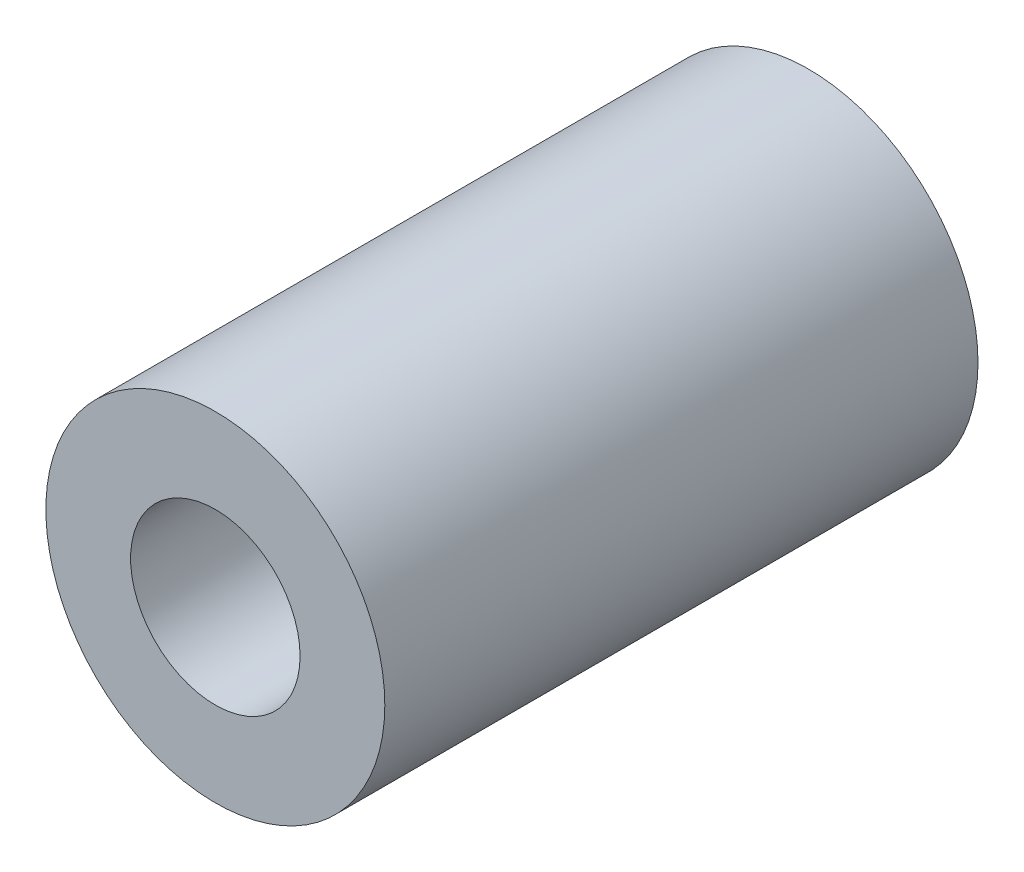
ISO-10303-21;
HEADER;
FILE_DESCRIPTION(('STEP AP214'),'2;1');
FILE_NAME('part.step','',(''),(''),'','','');
FILE_SCHEMA(('AUTOMOTIVE_DESIGN { 1 0 10303 214 1 1 1 1 }'));
ENDSEC;
DATA;
#1=APPLICATION_CONTEXT('core data for automotive mechanical design processes');
#2=APPLICATION_PROTOCOL_DEFINITION('international standard','automotive_design',2000,#1);
#3=PRODUCT_CONTEXT('',#1,'mechanical');
#4=PRODUCT('Part','Part','',(#3));
#5=PRODUCT_RELATED_PRODUCT_CATEGORY('part','',(#4));
#6=PRODUCT_DEFINITION_FORMATION('','',#4);
#7=PRODUCT_DEFINITION_CONTEXT('part definition',#1,'design');
#8=PRODUCT_DEFINITION('design','',#6,#7);
#9=PRODUCT_DEFINITION_SHAPE('','',#8);
#10=(LENGTH_UNIT() NAMED_UNIT(*) SI_UNIT(.MILLI.,.METRE.));
#11=(NAMED_UNIT(*) PLANE_ANGLE_UNIT() SI_UNIT($,.RADIAN.));
#12=(NAMED_UNIT(*) SI_UNIT($,.STERADIAN.) SOLID_ANGLE_UNIT());
#13=UNCERTAINTY_MEASURE_WITH_UNIT(LENGTH_MEASURE(1.E-05),#10,'distance_accuracy_value','');
#14=(GEOMETRIC_REPRESENTATION_CONTEXT(3) GLOBAL_UNCERTAINTY_ASSIGNED_CONTEXT((#13)) GLOBAL_UNIT_ASSIGNED_CONTEXT((#10,
#11,#12)) REPRESENTATION_CONTEXT('',''));
#15=CARTESIAN_POINT('',(0.,0.,0.));
#16=DIRECTION('',(0.,0.,1.));
#17=DIRECTION('',(1.,0.,0.));
#18=AXIS2_PLACEMENT_3D('',#15,#16,#17);
#19=CARTESIAN_POINT('',(0.,0.,35.));
#20=DIRECTION('',(0.,0.,1.));
#21=DIRECTION('',(1.,0.,0.));
#22=AXIS2_PLACEMENT_3D('',#19,#20,#21);
#23=PLANE('',#22);
#24=CARTESIAN_POINT('',(0.,0.,35.));
#25=DIRECTION('',(0.,0.,1.));
#26=DIRECTION('',(1.,0.,0.));
#27=AXIS2_PLACEMENT_3D('',#24,#25,#26);
#28=CIRCLE('',#27,20.);
#29=CARTESIAN_POINT('',(20.,0.,35.));
#30=VERTEX_POINT('',#29);
#31=EDGE_CURVE('E10',#30,#30,#28,.T.);
#32=ORIENTED_EDGE('',*,*,#31,.T.);
#33=EDGE_LOOP('',(#32));
#34=FACE_BOUND('',#33,.T.);
#35=CARTESIAN_POINT('',(0.,0.,35.));
#36=DIRECTION('',(0.,0.,1.));
#37=DIRECTION('',(1.,0.,0.));
#38=AXIS2_PLACEMENT_3D('',#35,#36,#37);
#39=CIRCLE('',#38,10.);
#40=CARTESIAN_POINT('',(10.,0.,35.));
#41=VERTEX_POINT('',#40);
#42=EDGE_CURVE('E44',#41,#41,#39,.T.);
#43=ORIENTED_EDGE('',*,*,#42,.F.);
#44=EDGE_LOOP('',(#43));
#45=FACE_BOUND('',#44,.T.);
#46=ADVANCED_FACE('F33',(#34,#45),#23,.T.);
#47=CARTESIAN_POINT('',(0.,0.,-35.));
#48=DIRECTION('',(0.,0.,1.));
#49=DIRECTION('',(1.,0.,0.));
#50=AXIS2_PLACEMENT_3D('',#47,#48,#49);
#51=PLANE('',#50);
#52=CARTESIAN_POINT('',(0.,0.,-35.));
#53=DIRECTION('',(0.,0.,1.));
#54=DIRECTION('',(1.,0.,0.));
#55=AXIS2_PLACEMENT_3D('',#52,#53,#54);
#56=CIRCLE('',#55,20.);
#57=CARTESIAN_POINT('',(20.,0.,-35.));
#58=VERTEX_POINT('',#57);
#59=EDGE_CURVE('E37',#58,#58,#56,.T.);
#60=ORIENTED_EDGE('',*,*,#59,.F.);
#61=EDGE_LOOP('',(#60));
#62=FACE_BOUND('',#61,.T.);
#63=CARTESIAN_POINT('',(0.,0.,-35.));
#64=DIRECTION('',(0.,0.,1.));
#65=DIRECTION('',(1.,0.,0.));
#66=AXIS2_PLACEMENT_3D('',#63,#64,#65);
#67=CIRCLE('',#66,10.);
#68=CARTESIAN_POINT('',(10.,0.,-35.));
#69=VERTEX_POINT('',#68);
#70=EDGE_CURVE('E46',#69,#69,#67,.T.);
#71=ORIENTED_EDGE('',*,*,#70,.T.);
#72=EDGE_LOOP('',(#71));
#73=FACE_BOUND('',#72,.T.);
#74=ADVANCED_FACE('F56',(#62,#73),#51,.F.);
#75=CARTESIAN_POINT('',(0.,0.,35.));
#76=DIRECTION('',(0.,0.,-1.));
#77=DIRECTION('',(-1.,0.,0.));
#78=AXIS2_PLACEMENT_3D('',#75,#76,#77);
#79=CYLINDRICAL_SURFACE('',#78,20.);
#80=ORIENTED_EDGE('',*,*,#31,.F.);
#81=EDGE_LOOP('',(#80));
#82=FACE_BOUND('',#81,.T.);
#83=ORIENTED_EDGE('',*,*,#59,.T.);
#84=EDGE_LOOP('',(#83));
#85=FACE_BOUND('',#84,.T.);
#86=ADVANCED_FACE('F35',(#82,#85),#79,.T.);
#87=CARTESIAN_POINT('',(0.,0.,35.));
#88=DIRECTION('',(0.,0.,-1.));
#89=DIRECTION('',(-1.,0.,0.));
#90=AXIS2_PLACEMENT_3D('',#87,#88,#89);
#91=CYLINDRICAL_SURFACE('',#90,10.);
#92=ORIENTED_EDGE('',*,*,#42,.T.);
#93=EDGE_LOOP('',(#92));
#94=FACE_BOUND('',#93,.T.);
#95=ORIENTED_EDGE('',*,*,#70,.F.);
#96=EDGE_LOOP('',(#95));
#97=FACE_BOUND('',#96,.T.);
#98=ADVANCED_FACE('F52',(#94,#97),#91,.F.);
#99=CLOSED_SHELL('',(#46,#74,#86,#98));
#100=MANIFOLD_SOLID_BREP('B2',#99);
#101=ADVANCED_BREP_SHAPE_REPRESENTATION('',(#18,#100),#14);
#102=SHAPE_DEFINITION_REPRESENTATION(#9,#101);
ENDSEC;
END-ISO-10303-21;
